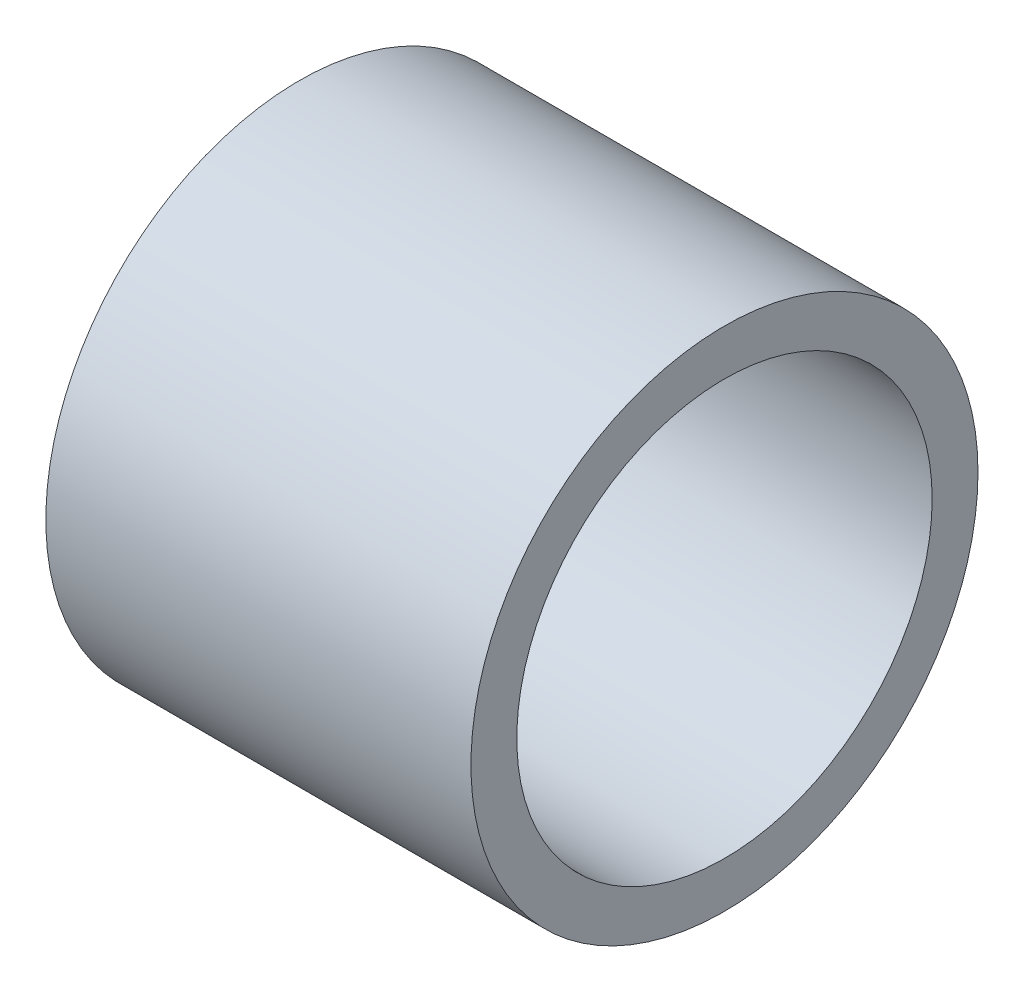
ISO-10303-21;
HEADER;
FILE_DESCRIPTION(('STEP AP214'),'2;1');
FILE_NAME('part.step','',(''),(''),'','','');
FILE_SCHEMA(('AUTOMOTIVE_DESIGN { 1 0 10303 214 1 1 1 1 }'));
ENDSEC;
DATA;
#1=APPLICATION_CONTEXT('core data for automotive mechanical design processes');
#2=APPLICATION_PROTOCOL_DEFINITION('international standard','automotive_design',2000,#1);
#3=PRODUCT_CONTEXT('',#1,'mechanical');
#4=PRODUCT('Part','Part','',(#3));
#5=PRODUCT_RELATED_PRODUCT_CATEGORY('part','',(#4));
#6=PRODUCT_DEFINITION_FORMATION('','',#4);
#7=PRODUCT_DEFINITION_CONTEXT('part definition',#1,'design');
#8=PRODUCT_DEFINITION('design','',#6,#7);
#9=PRODUCT_DEFINITION_SHAPE('','',#8);
#10=(LENGTH_UNIT() NAMED_UNIT(*) SI_UNIT(.MILLI.,.METRE.));
#11=(NAMED_UNIT(*) PLANE_ANGLE_UNIT() SI_UNIT($,.RADIAN.));
#12=(NAMED_UNIT(*) SI_UNIT($,.STERADIAN.) SOLID_ANGLE_UNIT());
#13=UNCERTAINTY_MEASURE_WITH_UNIT(LENGTH_MEASURE(1.E-05),#10,'distance_accuracy_value','');
#14=(GEOMETRIC_REPRESENTATION_CONTEXT(3) GLOBAL_UNCERTAINTY_ASSIGNED_CONTEXT((#13)) GLOBAL_UNIT_ASSIGNED_CONTEXT((#10,
#11,#12)) REPRESENTATION_CONTEXT('',''));
#15=CARTESIAN_POINT('',(0.,0.,0.));
#16=DIRECTION('',(0.,0.,1.));
#17=DIRECTION('',(1.,0.,0.));
#18=AXIS2_PLACEMENT_3D('',#15,#16,#17);
#19=CARTESIAN_POINT('',(3.3274,0.,0.));
#20=DIRECTION('',(1.,0.,0.));
#21=DIRECTION('',(0.,0.,-1.));
#22=AXIS2_PLACEMENT_3D('',#19,#20,#21);
#23=PLANE('',#22);
#24=CARTESIAN_POINT('',(3.3274,0.,0.));
#25=DIRECTION('',(1.,0.,0.));
#26=DIRECTION('',(0.,0.,-1.));
#27=AXIS2_PLACEMENT_3D('',#24,#25,#26);
#28=CIRCLE('',#27,1.984375);
#29=CARTESIAN_POINT('',(3.3274,0.,-1.984375));
#30=VERTEX_POINT('',#29);
#31=EDGE_CURVE('E10',#30,#30,#28,.T.);
#32=ORIENTED_EDGE('',*,*,#31,.T.);
#33=EDGE_LOOP('',(#32));
#34=FACE_BOUND('',#33,.T.);
#35=CARTESIAN_POINT('',(3.3274,0.,0.));
#36=DIRECTION('',(1.,0.,0.));
#37=DIRECTION('',(0.,0.,-1.));
#38=AXIS2_PLACEMENT_3D('',#35,#36,#37);
#39=CIRCLE('',#38,1.6256);
#40=CARTESIAN_POINT('',(3.3274,0.,-1.6256));
#41=VERTEX_POINT('',#40);
#42=EDGE_CURVE('E46',#41,#41,#39,.T.);
#43=ORIENTED_EDGE('',*,*,#42,.F.);
#44=EDGE_LOOP('',(#43));
#45=FACE_BOUND('',#44,.T.);
#46=ADVANCED_FACE('F35',(#34,#45),#23,.T.);
#47=CARTESIAN_POINT('',(0.,0.,0.));
#48=DIRECTION('',(1.,0.,0.));
#49=DIRECTION('',(0.,0.,-1.));
#50=AXIS2_PLACEMENT_3D('',#47,#48,#49);
#51=PLANE('',#50);
#52=CARTESIAN_POINT('',(0.,0.,0.));
#53=DIRECTION('',(1.,0.,0.));
#54=DIRECTION('',(0.,0.,-1.));
#55=AXIS2_PLACEMENT_3D('',#52,#53,#54);
#56=CIRCLE('',#55,1.984375);
#57=CARTESIAN_POINT('',(0.,0.,-1.984375));
#58=VERTEX_POINT('',#57);
#59=EDGE_CURVE('E39',#58,#58,#56,.T.);
#60=ORIENTED_EDGE('',*,*,#59,.F.);
#61=EDGE_LOOP('',(#60));
#62=FACE_BOUND('',#61,.T.);
#63=CARTESIAN_POINT('',(0.,0.,0.));
#64=DIRECTION('',(1.,0.,0.));
#65=DIRECTION('',(0.,0.,-1.));
#66=AXIS2_PLACEMENT_3D('',#63,#64,#65);
#67=CIRCLE('',#66,1.6256);
#68=CARTESIAN_POINT('',(0.,0.,-1.6256));
#69=VERTEX_POINT('',#68);
#70=EDGE_CURVE('E48',#69,#69,#67,.T.);
#71=ORIENTED_EDGE('',*,*,#70,.T.);
#72=EDGE_LOOP('',(#71));
#73=FACE_BOUND('',#72,.T.);
#74=ADVANCED_FACE('F58',(#62,#73),#51,.F.);
#75=CARTESIAN_POINT('',(3.3274,0.,0.));
#76=DIRECTION('',(-1.,0.,0.));
#77=DIRECTION('',(0.,0.,1.));
#78=AXIS2_PLACEMENT_3D('',#75,#76,#77);
#79=CYLINDRICAL_SURFACE('',#78,1.984375);
#80=ORIENTED_EDGE('',*,*,#31,.F.);
#81=EDGE_LOOP('',(#80));
#82=FACE_BOUND('',#81,.T.);
#83=ORIENTED_EDGE('',*,*,#59,.T.);
#84=EDGE_LOOP('',(#83));
#85=FACE_BOUND('',#84,.T.);
#86=ADVANCED_FACE('F37',(#82,#85),#79,.T.);
#87=CARTESIAN_POINT('',(3.3274,0.,0.));
#88=DIRECTION('',(-1.,0.,0.));
#89=DIRECTION('',(0.,0.,1.));
#90=AXIS2_PLACEMENT_3D('',#87,#88,#89);
#91=CYLINDRICAL_SURFACE('',#90,1.6256);
#92=ORIENTED_EDGE('',*,*,#42,.T.);
#93=EDGE_LOOP('',(#92));
#94=FACE_BOUND('',#93,.T.);
#95=ORIENTED_EDGE('',*,*,#70,.F.);
#96=EDGE_LOOP('',(#95));
#97=FACE_BOUND('',#96,.T.);
#98=ADVANCED_FACE('F54',(#94,#97),#91,.F.);
#99=CLOSED_SHELL('',(#46,#74,#86,#98));
#100=MANIFOLD_SOLID_BREP('B2',#99);
#101=ADVANCED_BREP_SHAPE_REPRESENTATION('',(#18,#100),#14);
#102=SHAPE_DEFINITION_REPRESENTATION(#9,#101);
ENDSEC;
END-ISO-10303-21;
